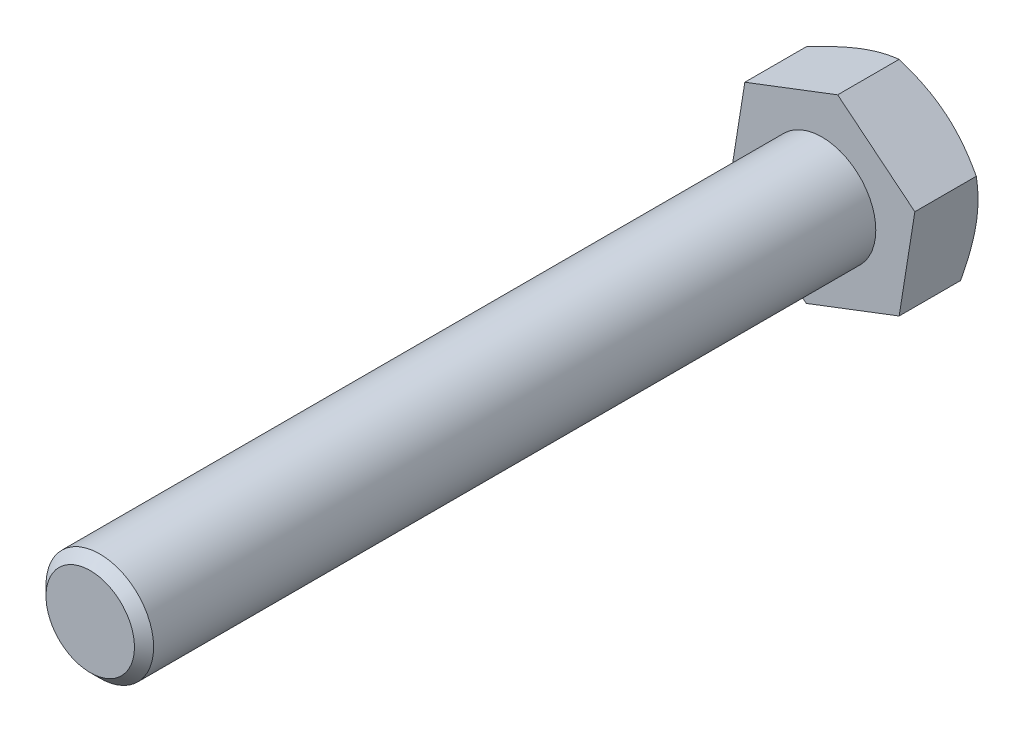
ISO-10303-21;
HEADER;
FILE_DESCRIPTION(('STEP AP214'),'2;1');
FILE_NAME('part.step','',(''),(''),'','','');
FILE_SCHEMA(('AUTOMOTIVE_DESIGN { 1 0 10303 214 1 1 1 1 }'));
ENDSEC;
DATA;
#1=APPLICATION_CONTEXT('core data for automotive mechanical design processes');
#2=APPLICATION_PROTOCOL_DEFINITION('international standard','automotive_design',2000,#1);
#3=PRODUCT_CONTEXT('',#1,'mechanical');
#4=PRODUCT('Part','Part','',(#3));
#5=PRODUCT_RELATED_PRODUCT_CATEGORY('part','',(#4));
#6=PRODUCT_DEFINITION_FORMATION('','',#4);
#7=PRODUCT_DEFINITION_CONTEXT('part definition',#1,'design');
#8=PRODUCT_DEFINITION('design','',#6,#7);
#9=PRODUCT_DEFINITION_SHAPE('','',#8);
#10=(LENGTH_UNIT() NAMED_UNIT(*) SI_UNIT(.MILLI.,.METRE.));
#11=(NAMED_UNIT(*) PLANE_ANGLE_UNIT() SI_UNIT($,.RADIAN.));
#12=(NAMED_UNIT(*) SI_UNIT($,.STERADIAN.) SOLID_ANGLE_UNIT());
#13=UNCERTAINTY_MEASURE_WITH_UNIT(LENGTH_MEASURE(1.E-05),#10,'distance_accuracy_value','');
#14=(GEOMETRIC_REPRESENTATION_CONTEXT(3) GLOBAL_UNCERTAINTY_ASSIGNED_CONTEXT((#13)) GLOBAL_UNIT_ASSIGNED_CONTEXT((#10,
#11,#12)) REPRESENTATION_CONTEXT('',''));
#15=CARTESIAN_POINT('',(0.,0.,0.));
#16=DIRECTION('',(0.,0.,1.));
#17=DIRECTION('',(1.,0.,0.));
#18=AXIS2_PLACEMENT_3D('',#15,#16,#17);
#19=CARTESIAN_POINT('',(4.31410859816444,1.64978796715734,3.5));
#20=DIRECTION('',(-0.630300575853816,-0.77635119892891,0.));
#21=DIRECTION('',(0.776351198928912,-0.630300575853814,0.));
#22=AXIS2_PLACEMENT_3D('',#19,#20,#21);
#23=PLANE('',#22);
#24=CARTESIAN_POINT('',(0.728096008666076,4.56118399938893,0.646015094764873));
#25=CARTESIAN_POINT('',(0.885674130723359,4.43325017097248,0.58740007686189));
#26=CARTESIAN_POINT('',(1.04461245744206,4.30421202561474,0.534091852875306));
#27=CARTESIAN_POINT('',(1.36524129681863,4.04390130235804,0.441041807841976));
#28=CARTESIAN_POINT('',(1.52693750661402,3.91262409909227,0.401332904485097));
#29=CARTESIAN_POINT('',(1.84832600478147,3.65169662741809,0.339520204109146));
#30=CARTESIAN_POINT('',(2.00796884352189,3.52208650595779,0.317005011012687));
#31=CARTESIAN_POINT('',(2.32800569811674,3.26225640068601,0.290126531617295));
#32=CARTESIAN_POINT('',(2.48839855071785,3.13203736129149,0.285740987637437));
#33=CARTESIAN_POINT('',(2.78810175042101,2.88871565377206,0.294864272433576));
#34=CARTESIAN_POINT('',(2.92745696113236,2.77557656197858,0.306133025294195));
#35=CARTESIAN_POINT('',(3.20525948396795,2.55003547907886,0.34184840920224));
#36=CARTESIAN_POINT('',(3.34370583522165,2.43763426807994,0.366307240779474));
#37=CARTESIAN_POINT('',(3.62208113780253,2.21162815929531,0.427452447986291));
#38=CARTESIAN_POINT('',(3.76197485613896,2.0980518663142,0.464398017203505));
#39=CARTESIAN_POINT('',(4.03967580530457,1.8725932485962,0.548249938619394));
#40=CARTESIAN_POINT('',(4.17748659391991,1.7607080353796,0.595136588379825));
#41=CARTESIAN_POINT('',(4.31430859816442,1.6496255920424,0.646015094764873));
#42=B_SPLINE_CURVE_WITH_KNOTS('',3,(#24,#25,#26,#27,#28,#29,#30,#31,#32,#33,#34,#35,#36,#37,#38,
#39,#40,#41),.UNSPECIFIED.,.F.,.F.,(4,2,2,2,2,2,2,2,4),(0.,0.634049662235825,1.26962339534485,
1.88946692724367,2.50854925388474,3.04759704586734,3.58714430245306,4.13865964890734,
4.68909198564512),.UNSPECIFIED.);
#43=CARTESIAN_POINT('',(0.728296008666071,4.56102162427396,0.645940724502966));
#44=VERTEX_POINT('',#43);
#45=CARTESIAN_POINT('',(4.31410859816443,1.64978796715736,0.645940724502966));
#46=VERTEX_POINT('',#45);
#47=EDGE_CURVE('E54',#44,#46,#42,.T.);
#48=ORIENTED_EDGE('',*,*,#47,.F.);
#49=DIRECTION('',(0.,0.,-0.999999999999999));
#50=VECTOR('',#49,1.);
#51=CARTESIAN_POINT('',(0.728296008666071,4.56102162427392,3.5));
#52=LINE('',#51,#50);
#53=CARTESIAN_POINT('',(0.728296008666071,4.56102162427392,3.5));
#54=VERTEX_POINT('',#53);
#55=EDGE_CURVE('E123',#54,#44,#52,.T.);
#56=ORIENTED_EDGE('',*,*,#55,.F.);
#57=DIRECTION('',(-0.776351198928911,0.630300575853814,0.));
#58=VECTOR('',#57,1.);
#59=CARTESIAN_POINT('',(4.31410859816444,1.64978796715734,3.5));
#60=LINE('',#59,#58);
#61=CARTESIAN_POINT('',(4.31410859816444,1.64978796715734,3.5));
#62=VERTEX_POINT('',#61);
#63=EDGE_CURVE('E217',#62,#54,#60,.T.);
#64=ORIENTED_EDGE('',*,*,#63,.F.);
#65=DIRECTION('',(0.,0.,-0.999999999999999));
#66=VECTOR('',#65,1.);
#67=CARTESIAN_POINT('',(4.31410859816444,1.64978796715734,3.5));
#68=LINE('',#67,#66);
#69=EDGE_CURVE('E111',#62,#46,#68,.T.);
#70=ORIENTED_EDGE('',*,*,#69,.T.);
#71=EDGE_LOOP('',(#48,#56,#64,#70));
#72=FACE_BOUND('',#71,.T.);
#73=ADVANCED_FACE('F39',(#72),#23,.F.);
#74=CARTESIAN_POINT('',(0.728296008666071,4.56102162427392,3.5));
#75=DIRECTION('',(0.357189572604036,-0.934031910173819,0.));
#76=DIRECTION('',(0.934031910173821,0.357189572604035,0.));
#77=AXIS2_PLACEMENT_3D('',#74,#75,#76);
#78=PLANE('',#77);
#79=CARTESIAN_POINT('',(-3.58601258949838,2.91115717373982,0.64600253934427));
#80=CARTESIAN_POINT('',(-3.3964302686063,2.98365665414847,0.58738855259769));
#81=CARTESIAN_POINT('',(-3.2052114832614,3.05678194619389,0.534081423879444));
#82=CARTESIAN_POINT('',(-2.81946281208066,3.20429875101695,0.441033652067695));
#83=CARTESIAN_POINT('',(-2.62492607243057,3.27869288480888,0.401325925234687));
#84=CARTESIAN_POINT('',(-2.23826349077356,3.42655918442848,0.339515550754474));
#85=CARTESIAN_POINT('',(-2.04619713883928,3.50000860024796,0.31700151412636));
#86=CARTESIAN_POINT('',(-1.66116077410906,3.64725300705781,0.290125269966039));
#87=CARTESIAN_POINT('',(-1.46819216065987,3.72104746291437,0.285740805698836));
#88=CARTESIAN_POINT('',(-1.1076246464062,3.85893456817097,0.294865796993243));
#89=CARTESIAN_POINT('',(-0.939971748815347,3.92304786685381,0.306134758835129));
#90=CARTESIAN_POINT('',(-0.605758202424189,4.05085676984055,0.341849576843295));
#91=CARTESIAN_POINT('',(-0.439198709459405,4.11455193213342,0.366307631291774));
#92=CARTESIAN_POINT('',(-0.104296171321096,4.24262431719719,0.427450412547139));
#93=CARTESIAN_POINT('',(0.0640044901874317,4.30698533173899,0.464394301726765));
#94=CARTESIAN_POINT('',(0.398095758704753,4.43474747360226,0.548242224692455));
#95=CARTESIAN_POINT('',(0.563890645367384,4.49815023753562,0.595126559211831));
#96=CARTESIAN_POINT('',(0.728496008666049,4.56109810765075,0.646002539344267));
#97=B_SPLINE_CURVE_WITH_KNOTS('',3,(#79,#80,#81,#82,#83,#84,#85,#86,#87,#88,#89,#90,#91,#92,#93,
#94,#95,#96),.UNSPECIFIED.,.F.,.F.,(4,2,2,2,2,2,2,2,4),(0.,0.634046684350333,1.26961735802463,
1.88945819657704,2.5085378623704,3.04756640852402,3.58709434671711,4.13858935250354,
4.68900149283678),.UNSPECIFIED.);
#98=CARTESIAN_POINT('',(-3.58581258949838,2.91123365711662,0.645940724502966));
#99=VERTEX_POINT('',#98);
#100=EDGE_CURVE('E161',#99,#44,#97,.T.);
#101=ORIENTED_EDGE('',*,*,#100,.F.);
#102=DIRECTION('',(0.,0.,-0.999999999999999));
#103=VECTOR('',#102,1.);
#104=CARTESIAN_POINT('',(-3.58581258949836,2.91123365711661,3.5));
#105=LINE('',#104,#103);
#106=CARTESIAN_POINT('',(-3.58581258949836,2.91123365711661,3.5));
#107=VERTEX_POINT('',#106);
#108=EDGE_CURVE('E120',#107,#99,#105,.T.);
#109=ORIENTED_EDGE('',*,*,#108,.F.);
#110=DIRECTION('',(-0.934031910173821,-0.357189572604035,0.));
#111=VECTOR('',#110,1.);
#112=CARTESIAN_POINT('',(0.728296008666071,4.56102162427392,3.5));
#113=LINE('',#112,#111);
#114=EDGE_CURVE('E218',#54,#107,#113,.T.);
#115=ORIENTED_EDGE('',*,*,#114,.F.);
#116=ORIENTED_EDGE('',*,*,#55,.T.);
#117=EDGE_LOOP('',(#101,#109,#115,#116));
#118=FACE_BOUND('',#117,.T.);
#119=ADVANCED_FACE('F143',(#118),#78,.F.);
#120=CARTESIAN_POINT('',(-3.58581258949836,2.91123365711661,3.5));
#121=DIRECTION('',(0.987490148457852,-0.157680711244909,0.));
#122=DIRECTION('',(0.157680711244909,0.98749014845785,0.));
#123=AXIS2_PLACEMENT_3D('',#120,#121,#122);
#124=PLANE('',#123);
#125=CARTESIAN_POINT('',(-4.31414053381699,-1.64998796715732,0.645999192859046));
#126=CARTESIAN_POINT('',(-4.28213579601297,-1.44955531413399,0.587385480956758));
#127=CARTESIAN_POINT('',(-4.24985479495611,-1.24739253674461,0.534078644171229));
#128=CARTESIAN_POINT('',(-4.18473382496962,-0.839566393572312,0.441031478263429));
#129=CARTESIAN_POINT('',(-4.1518926990176,-0.633895781828887,0.401324065020667));
#130=CARTESIAN_POINT('',(-4.08661744690747,-0.225103432479714,0.339514310483449));
#131=CARTESIAN_POINT('',(-4.05419336356473,-0.0220445889411769,0.317000582099601));
#132=CARTESIAN_POINT('',(-3.98919264710435,0.385028455317571,0.290124933716513));
#133=CARTESIAN_POINT('',(-3.95661625021299,0.589041176648669,0.2857407572344));
#134=CARTESIAN_POINT('',(-3.8957465380207,0.970243421709451,0.294866203366515));
#135=CARTESIAN_POINT('',(-3.86744410617786,1.14749003863253,0.306135220902628));
#136=CARTESIAN_POINT('',(-3.81102363076533,1.50082852373506,0.341849888067359));
#137=CARTESIAN_POINT('',(-3.78290578231197,1.67691916998033,0.366307735379148));
#138=CARTESIAN_POINT('',(-3.72636899870327,2.0309860460003,0.427449870025167));
#139=CARTESIAN_POINT('',(-3.697957218403,2.20891746782831,0.464393311412568));
#140=CARTESIAN_POINT('',(-3.64155738894037,2.56212665574572,0.54824016864394));
#141=CARTESIAN_POINT('',(-3.61356861733167,2.7374089462226,0.595123886066506));
#142=CARTESIAN_POINT('',(-3.58578065384587,2.91143365711662,0.645999192859053));
#143=B_SPLINE_CURVE_WITH_KNOTS('',3,(#125,#126,#127,#128,#129,#130,#131,#132,#133,#134,#135,
#136,#137,#138,#139,#140,#141,#142),.UNSPECIFIED.,.F.,.F.,(4,2,2,2,2,2,2,2,4),(0.,
0.634045890632966,1.26961574885399,1.88945586952981,2.50853482610862,3.04755824248227,
3.58708103155535,4.13857061575326,4.68897737294786),.UNSPECIFIED.);
#144=CARTESIAN_POINT('',(-4.31410859816447,-1.64978796715732,0.645940724502962));
#145=VERTEX_POINT('',#144);
#146=EDGE_CURVE('E188',#145,#99,#143,.T.);
#147=ORIENTED_EDGE('',*,*,#146,.F.);
#148=DIRECTION('',(0.,0.,-0.999999999999999));
#149=VECTOR('',#148,1.);
#150=CARTESIAN_POINT('',(-4.31410859816445,-1.64978796715732,3.49999999999999));
#151=LINE('',#150,#149);
#152=CARTESIAN_POINT('',(-4.31410859816445,-1.64978796715732,3.49999999999999));
#153=VERTEX_POINT('',#152);
#154=EDGE_CURVE('E113',#153,#145,#151,.T.);
#155=ORIENTED_EDGE('',*,*,#154,.F.);
#156=DIRECTION('',(-0.15768071124491,-0.98749014845785,0.));
#157=VECTOR('',#156,1.);
#158=CARTESIAN_POINT('',(-3.58581258949836,2.91123365711661,3.5));
#159=LINE('',#158,#157);
#160=EDGE_CURVE('E221',#107,#153,#159,.T.);
#161=ORIENTED_EDGE('',*,*,#160,.F.);
#162=ORIENTED_EDGE('',*,*,#108,.T.);
#163=EDGE_LOOP('',(#147,#155,#161,#162));
#164=FACE_BOUND('',#163,.T.);
#165=ADVANCED_FACE('F148',(#164),#124,.F.);
#166=CARTESIAN_POINT('',(-4.31410859816445,-1.64978796715732,3.49999999999999));
#167=DIRECTION('',(0.630300575853816,0.77635119892891,0.));
#168=DIRECTION('',(-0.776351198928912,0.630300575853814,0.));
#169=AXIS2_PLACEMENT_3D('',#166,#167,#168);
#170=PLANE('',#169);
#171=CARTESIAN_POINT('',(-0.728096008666083,-4.56118399938888,0.646015094764869));
#172=CARTESIAN_POINT('',(-0.885674130723374,-4.43325017097244,0.587400076861882));
#173=CARTESIAN_POINT('',(-1.04461245744208,-4.30421202561471,0.534091852875296));
#174=CARTESIAN_POINT('',(-1.36524129681865,-4.04390130235801,0.441041807841965));
#175=CARTESIAN_POINT('',(-1.52693750661404,-3.91262409909224,0.401332904485087));
#176=CARTESIAN_POINT('',(-1.84832600478149,-3.65169662741806,0.339520204109138));
#177=CARTESIAN_POINT('',(-2.0079688435219,-3.52208650595777,0.317005011012681));
#178=CARTESIAN_POINT('',(-2.32800569811675,-3.26225640068599,0.290126531617288));
#179=CARTESIAN_POINT('',(-2.48839855071786,-3.13203736129146,0.285740987637429));
#180=CARTESIAN_POINT('',(-2.78810175042102,-2.88871565377204,0.29486427243357));
#181=CARTESIAN_POINT('',(-2.92745696113237,-2.77557656197855,0.306133025294192));
#182=CARTESIAN_POINT('',(-3.20525948396796,-2.55003547907884,0.34184840920224));
#183=CARTESIAN_POINT('',(-3.34370583522167,-2.43763426807992,0.366307240779474));
#184=CARTESIAN_POINT('',(-3.62208113780255,-2.21162815929529,0.427452447986292));
#185=CARTESIAN_POINT('',(-3.76197485613898,-2.09805186631418,0.464398017203509));
#186=CARTESIAN_POINT('',(-4.03967580530459,-1.87259324859617,0.548249938619397));
#187=CARTESIAN_POINT('',(-4.17748659391994,-1.76070803537958,0.595136588379828));
#188=CARTESIAN_POINT('',(-4.31430859816446,-1.64962559204238,0.646015094764869));
#189=B_SPLINE_CURVE_WITH_KNOTS('',3,(#171,#172,#173,#174,#175,#176,#177,#178,#179,#180,#181,
#182,#183,#184,#185,#186,#187,#188),.UNSPECIFIED.,.F.,.F.,(4,2,2,2,2,2,2,2,4),(0.,
0.634049662235823,1.26962339534484,1.88946692724367,2.50854925388473,3.04759704586733,
3.58714430245305,4.13865964890734,4.68909198564513),.UNSPECIFIED.);
#190=CARTESIAN_POINT('',(-0.728296008666099,-4.56102162427394,0.645940724502962));
#191=VERTEX_POINT('',#190);
#192=EDGE_CURVE('E108',#191,#145,#189,.T.);
#193=ORIENTED_EDGE('',*,*,#192,.F.);
#194=DIRECTION('',(0.,0.,-0.999999999999999));
#195=VECTOR('',#194,1.);
#196=CARTESIAN_POINT('',(-0.728296008666078,-4.56102162427393,3.49999999999999));
#197=LINE('',#196,#195);
#198=CARTESIAN_POINT('',(-0.728296008666078,-4.56102162427393,3.49999999999999));
#199=VERTEX_POINT('',#198);
#200=EDGE_CURVE('E107',#199,#191,#197,.T.);
#201=ORIENTED_EDGE('',*,*,#200,.F.);
#202=DIRECTION('',(0.776351198928912,-0.630300575853814,0.));
#203=VECTOR('',#202,1.);
#204=CARTESIAN_POINT('',(-4.31410859816445,-1.64978796715732,3.49999999999999));
#205=LINE('',#204,#203);
#206=EDGE_CURVE('E225',#153,#199,#205,.T.);
#207=ORIENTED_EDGE('',*,*,#206,.F.);
#208=ORIENTED_EDGE('',*,*,#154,.T.);
#209=EDGE_LOOP('',(#193,#201,#207,#208));
#210=FACE_BOUND('',#209,.T.);
#211=ADVANCED_FACE('F194',(#210),#170,.F.);
#212=CARTESIAN_POINT('',(-0.728296008666078,-4.56102162427393,3.49999999999999));
#213=DIRECTION('',(-0.357189572604035,0.934031910173819,0.));
#214=DIRECTION('',(-0.934031910173821,-0.357189572604034,0.));
#215=AXIS2_PLACEMENT_3D('',#212,#213,#214);
#216=PLANE('',#215);
#217=CARTESIAN_POINT('',(3.58601258949835,-2.91115717373982,0.64600253934427));
#218=CARTESIAN_POINT('',(3.39643026860627,-2.98365665414848,0.587388552597689));
#219=CARTESIAN_POINT('',(3.20521148326138,-3.0567819461939,0.534081423879442));
#220=CARTESIAN_POINT('',(2.81946281208064,-3.20429875101696,0.441033652067692));
#221=CARTESIAN_POINT('',(2.62492607243055,-3.27869288480889,0.401325925234685));
#222=CARTESIAN_POINT('',(2.23826349077354,-3.4265591844285,0.339515550754476));
#223=CARTESIAN_POINT('',(2.04619713883926,-3.50000860024798,0.317001514126363));
#224=CARTESIAN_POINT('',(1.66116077410904,-3.64725300705782,0.290125269966038));
#225=CARTESIAN_POINT('',(1.46819216065984,-3.72104746291435,0.285740805698828));
#226=CARTESIAN_POINT('',(1.10762464640617,-3.85893456817096,0.294865796993237));
#227=CARTESIAN_POINT('',(0.939971748815325,-3.92304786685382,0.30613475883513));
#228=CARTESIAN_POINT('',(0.605758202424171,-4.05085676984057,0.341849576843303));
#229=CARTESIAN_POINT('',(0.439198709459383,-4.11455193213343,0.36630763129178));
#230=CARTESIAN_POINT('',(0.104296171321073,-4.24262431719721,0.427450412547146));
#231=CARTESIAN_POINT('',(-0.0640044901874535,-4.30698533173901,0.464394301726774));
#232=CARTESIAN_POINT('',(-0.39809575870478,-4.43474747360227,0.548242224692464));
#233=CARTESIAN_POINT('',(-0.563890645367418,-4.49815023753562,0.595126559211837));
#234=CARTESIAN_POINT('',(-0.728496008666098,-4.56109810765073,0.646002539344263));
#235=B_SPLINE_CURVE_WITH_KNOTS('',3,(#217,#218,#219,#220,#221,#222,#223,#224,#225,#226,#227,
#228,#229,#230,#231,#232,#233,#234),.UNSPECIFIED.,.F.,.F.,(4,2,2,2,2,2,2,2,4),(0.,
0.63404668435033,1.26961735802463,1.88945819657703,2.50853786237039,3.04756640852402,
3.58709434671712,4.13858935250354,4.68900149283679),.UNSPECIFIED.);
#236=CARTESIAN_POINT('',(3.58581258949836,-2.9112336571166,0.645940724502969));
#237=VERTEX_POINT('',#236);
#238=EDGE_CURVE('E93',#237,#191,#235,.T.);
#239=ORIENTED_EDGE('',*,*,#238,.F.);
#240=DIRECTION('',(0.,0.,-0.999999999999999));
#241=VECTOR('',#240,1.);
#242=CARTESIAN_POINT('',(3.58581258949836,-2.9112336571166,3.5));
#243=LINE('',#242,#241);
#244=CARTESIAN_POINT('',(3.58581258949836,-2.9112336571166,3.5));
#245=VERTEX_POINT('',#244);
#246=EDGE_CURVE('E105',#245,#237,#243,.T.);
#247=ORIENTED_EDGE('',*,*,#246,.F.);
#248=DIRECTION('',(0.934031910173821,0.357189572604035,0.));
#249=VECTOR('',#248,1.);
#250=CARTESIAN_POINT('',(-0.728296008666078,-4.56102162427393,3.49999999999999));
#251=LINE('',#250,#249);
#252=EDGE_CURVE('E227',#199,#245,#251,.T.);
#253=ORIENTED_EDGE('',*,*,#252,.F.);
#254=ORIENTED_EDGE('',*,*,#200,.T.);
#255=EDGE_LOOP('',(#239,#247,#253,#254));
#256=FACE_BOUND('',#255,.T.);
#257=ADVANCED_FACE('F103',(#256),#216,.F.);
#258=CARTESIAN_POINT('',(3.58581258949836,-2.9112336571166,3.5));
#259=DIRECTION('',(-0.987490148457852,0.157680711244909,0.));
#260=DIRECTION('',(-0.157680711244909,-0.987490148457849,0.));
#261=AXIS2_PLACEMENT_3D('',#258,#259,#260);
#262=PLANE('',#261);
#263=CARTESIAN_POINT('',(4.31414053381696,1.64998796715735,0.645999192859053));
#264=CARTESIAN_POINT('',(4.28213579601296,1.44955531413401,0.587385480956762));
#265=CARTESIAN_POINT('',(4.2498547949561,1.24739253674463,0.534078644171232));
#266=CARTESIAN_POINT('',(4.18473382496962,0.839566393572337,0.441031478263431));
#267=CARTESIAN_POINT('',(4.1518926990176,0.633895781828914,0.401324065020669));
#268=CARTESIAN_POINT('',(4.08661744690747,0.225103432479742,0.339514310483448));
#269=CARTESIAN_POINT('',(4.05419336356474,0.0220445889412032,0.317000582099597));
#270=CARTESIAN_POINT('',(3.98919264710433,-0.38502845531754,0.290124933716513));
#271=CARTESIAN_POINT('',(3.95661625021294,-0.589041176648633,0.285740757234408));
#272=CARTESIAN_POINT('',(3.89574653802066,-0.970243421709419,0.294866203366521));
#273=CARTESIAN_POINT('',(3.86744410617785,-1.1474900386325,0.306135220902626));
#274=CARTESIAN_POINT('',(3.81102363076534,-1.50082852373505,0.341849888067351));
#275=CARTESIAN_POINT('',(3.78290578231197,-1.67691916998032,0.366307735379142));
#276=CARTESIAN_POINT('',(3.72636899870326,-2.03098604600029,0.427449870025163));
#277=CARTESIAN_POINT('',(3.697957218403,-2.20891746782831,0.464393311412564));
#278=CARTESIAN_POINT('',(3.64155738894037,-2.56212665574572,0.548240168643937));
#279=CARTESIAN_POINT('',(3.61356861733166,-2.7374089462226,0.595123886066504));
#280=CARTESIAN_POINT('',(3.58578065384584,-2.91143365711662,0.645999192859053));
#281=B_SPLINE_CURVE_WITH_KNOTS('',3,(#263,#264,#265,#266,#267,#268,#269,#270,#271,#272,#273,
#274,#275,#276,#277,#278,#279,#280),.UNSPECIFIED.,.F.,.F.,(4,2,2,2,2,2,2,2,4),(0.,
0.634045890632967,1.26961574885399,1.88945586952981,2.50853482610862,3.04755824248227,
3.58708103155536,4.13857061575328,4.68897737294788),.UNSPECIFIED.);
#282=EDGE_CURVE('E90',#46,#237,#281,.T.);
#283=ORIENTED_EDGE('',*,*,#282,.F.);
#284=ORIENTED_EDGE('',*,*,#69,.F.);
#285=DIRECTION('',(0.157680711244909,0.987490148457849,0.));
#286=VECTOR('',#285,1.);
#287=CARTESIAN_POINT('',(3.58581258949836,-2.9112336571166,3.5));
#288=LINE('',#287,#286);
#289=EDGE_CURVE('E62',#245,#62,#288,.T.);
#290=ORIENTED_EDGE('',*,*,#289,.F.);
#291=ORIENTED_EDGE('',*,*,#246,.T.);
#292=EDGE_LOOP('',(#283,#284,#290,#291));
#293=FACE_BOUND('',#292,.T.);
#294=ADVANCED_FACE('F110',(#293),#262,.F.);
#295=CARTESIAN_POINT('',(0.,0.,3.5));
#296=DIRECTION('',(0.,0.,0.999999999999999));
#297=DIRECTION('',(1.,0.,0.));
#298=AXIS2_PLACEMENT_3D('',#295,#296,#297);
#299=PLANE('',#298);
#300=ORIENTED_EDGE('',*,*,#63,.T.);
#301=ORIENTED_EDGE('',*,*,#114,.T.);
#302=ORIENTED_EDGE('',*,*,#160,.T.);
#303=ORIENTED_EDGE('',*,*,#206,.T.);
#304=ORIENTED_EDGE('',*,*,#252,.T.);
#305=ORIENTED_EDGE('',*,*,#289,.T.);
#306=EDGE_LOOP('',(#300,#301,#302,#303,#304,#305));
#307=FACE_BOUND('',#306,.T.);
#308=CARTESIAN_POINT('',(0.,0.,3.5));
#309=DIRECTION('',(0.,0.,0.999999999999999));
#310=DIRECTION('',(1.,0.,0.));
#311=AXIS2_PLACEMENT_3D('',#308,#309,#310);
#312=CIRCLE('',#311,2.5);
#313=CARTESIAN_POINT('',(2.49999999999999,0.,3.5));
#314=VERTEX_POINT('',#313);
#315=EDGE_CURVE('E160',#314,#314,#312,.T.);
#316=ORIENTED_EDGE('',*,*,#315,.F.);
#317=EDGE_LOOP('',(#316));
#318=FACE_BOUND('',#317,.T.);
#319=ADVANCED_FACE('F204',(#307,#318),#299,.T.);
#320=CARTESIAN_POINT('',(0.,0.,37.4999999999999));
#321=DIRECTION('',(0.,0.,-0.999999999999999));
#322=DIRECTION('',(-1.,0.,0.));
#323=AXIS2_PLACEMENT_3D('',#320,#321,#322);
#324=CYLINDRICAL_SURFACE('',#323,2.5);
#325=CARTESIAN_POINT('',(0.,0.,37.0549999999999));
#326=DIRECTION('',(0.,0.,0.999999999999999));
#327=DIRECTION('',(1.,0.,0.));
#328=AXIS2_PLACEMENT_3D('',#325,#326,#327);
#329=CIRCLE('',#328,2.5);
#330=CARTESIAN_POINT('',(2.50000000000001,0.,37.0549999999999));
#331=VERTEX_POINT('',#330);
#332=EDGE_CURVE('E11',#331,#331,#329,.F.);
#333=ORIENTED_EDGE('',*,*,#332,.T.);
#334=EDGE_LOOP('',(#333));
#335=FACE_BOUND('',#334,.T.);
#336=ORIENTED_EDGE('',*,*,#315,.T.);
#337=EDGE_LOOP('',(#336));
#338=FACE_BOUND('',#337,.T.);
#339=ADVANCED_FACE('F139',(#335,#338),#324,.T.);
#340=CARTESIAN_POINT('',(0.,0.,37.4999999999999));
#341=DIRECTION('',(0.,0.,0.999999999999999));
#342=DIRECTION('',(1.,0.,0.));
#343=AXIS2_PLACEMENT_3D('',#340,#341,#342);
#344=PLANE('',#343);
#345=CARTESIAN_POINT('',(0.,0.,37.4999999999999));
#346=DIRECTION('',(0.,0.,0.999999999999999));
#347=DIRECTION('',(1.,0.,0.));
#348=AXIS2_PLACEMENT_3D('',#345,#346,#347);
#349=CIRCLE('',#348,2.05499999999999);
#350=CARTESIAN_POINT('',(2.055,0.,37.4999999999999));
#351=VERTEX_POINT('',#350);
#352=EDGE_CURVE('E47',#351,#351,#349,.T.);
#353=ORIENTED_EDGE('',*,*,#352,.T.);
#354=EDGE_LOOP('',(#353));
#355=FACE_BOUND('',#354,.T.);
#356=ADVANCED_FACE('F128',(#355),#344,.T.);
#357=CARTESIAN_POINT('',(0.,0.,37.4999999999999));
#358=DIRECTION('',(0.,0.,-0.999999999999999));
#359=DIRECTION('',(-1.,0.,0.));
#360=AXIS2_PLACEMENT_3D('',#357,#358,#359);
#361=CONICAL_SURFACE('',#360,2.05499999999999,0.785398163397446);
#362=ORIENTED_EDGE('',*,*,#332,.F.);
#363=EDGE_LOOP('',(#362));
#364=FACE_BOUND('',#363,.T.);
#365=ORIENTED_EDGE('',*,*,#352,.F.);
#366=EDGE_LOOP('',(#365));
#367=FACE_BOUND('',#366,.T.);
#368=ADVANCED_FACE('F41',(#364,#367),#361,.T.);
#369=CARTESIAN_POINT('',(0.,0.,0.));
#370=DIRECTION('',(0.,0.,0.999999999999999));
#371=DIRECTION('',(1.,0.,0.));
#372=AXIS2_PLACEMENT_3D('',#369,#370,#371);
#373=CONICAL_SURFACE('',#372,3.5,1.0471975511966);
#374=CARTESIAN_POINT('',(0.,0.,0.));
#375=DIRECTION('',(0.,0.,-0.999999999999999));
#376=DIRECTION('',(-1.,0.,0.));
#377=AXIS2_PLACEMENT_3D('',#374,#375,#376);
#378=CIRCLE('',#377,3.5);
#379=CARTESIAN_POINT('',(-3.50000000000002,0.,0.));
#380=VERTEX_POINT('',#379);
#381=EDGE_CURVE('E98',#380,#380,#378,.T.);
#382=ORIENTED_EDGE('',*,*,#381,.F.);
#383=EDGE_LOOP('',(#382));
#384=FACE_BOUND('',#383,.T.);
#385=ORIENTED_EDGE('',*,*,#47,.T.);
#386=ORIENTED_EDGE('',*,*,#282,.T.);
#387=ORIENTED_EDGE('',*,*,#238,.T.);
#388=ORIENTED_EDGE('',*,*,#192,.T.);
#389=ORIENTED_EDGE('',*,*,#146,.T.);
#390=ORIENTED_EDGE('',*,*,#100,.T.);
#391=EDGE_LOOP('',(#385,#386,#387,#388,#389,#390));
#392=FACE_BOUND('',#391,.T.);
#393=ADVANCED_FACE('F92',(#384,#392),#373,.T.);
#394=CARTESIAN_POINT('',(0.,0.,0.));
#395=DIRECTION('',(0.,0.,0.999999999999999));
#396=DIRECTION('',(1.,0.,0.));
#397=AXIS2_PLACEMENT_3D('',#394,#395,#396);
#398=PLANE('',#397);
#399=ORIENTED_EDGE('',*,*,#381,.T.);
#400=EDGE_LOOP('',(#399));
#401=FACE_BOUND('',#400,.T.);
#402=ADVANCED_FACE('F136',(#401),#398,.F.);
#403=CLOSED_SHELL('',(#73,#119,#165,#211,#257,#294,#319,#339,#356,#368,#393,#402));
#404=MANIFOLD_SOLID_BREP('B2',#403);
#405=ADVANCED_BREP_SHAPE_REPRESENTATION('',(#18,#404),#14);
#406=SHAPE_DEFINITION_REPRESENTATION(#9,#405);
ENDSEC;
END-ISO-10303-21;
